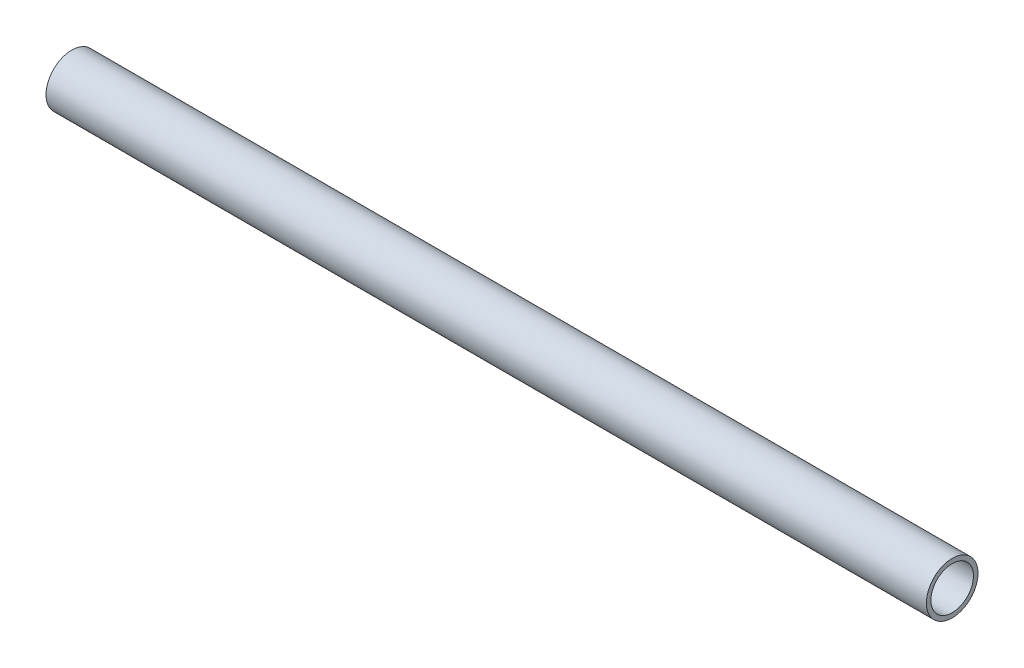
ISO-10303-21;
HEADER;
FILE_DESCRIPTION(('STEP AP214'),'2;1');
FILE_NAME('part.step','',(''),(''),'','','');
FILE_SCHEMA(('AUTOMOTIVE_DESIGN { 1 0 10303 214 1 1 1 1 }'));
ENDSEC;
DATA;
#1=APPLICATION_CONTEXT('core data for automotive mechanical design processes');
#2=APPLICATION_PROTOCOL_DEFINITION('international standard','automotive_design',2000,#1);
#3=PRODUCT_CONTEXT('',#1,'mechanical');
#4=PRODUCT('Part','Part','',(#3));
#5=PRODUCT_RELATED_PRODUCT_CATEGORY('part','',(#4));
#6=PRODUCT_DEFINITION_FORMATION('','',#4);
#7=PRODUCT_DEFINITION_CONTEXT('part definition',#1,'design');
#8=PRODUCT_DEFINITION('design','',#6,#7);
#9=PRODUCT_DEFINITION_SHAPE('','',#8);
#10=(LENGTH_UNIT() NAMED_UNIT(*) SI_UNIT(.MILLI.,.METRE.));
#11=(NAMED_UNIT(*) PLANE_ANGLE_UNIT() SI_UNIT($,.RADIAN.));
#12=(NAMED_UNIT(*) SI_UNIT($,.STERADIAN.) SOLID_ANGLE_UNIT());
#13=UNCERTAINTY_MEASURE_WITH_UNIT(LENGTH_MEASURE(1.E-05),#10,'distance_accuracy_value','');
#14=(GEOMETRIC_REPRESENTATION_CONTEXT(3) GLOBAL_UNCERTAINTY_ASSIGNED_CONTEXT((#13)) GLOBAL_UNIT_ASSIGNED_CONTEXT((#10,
#11,#12)) REPRESENTATION_CONTEXT('',''));
#15=CARTESIAN_POINT('',(0.,0.,0.));
#16=DIRECTION('',(0.,0.,1.));
#17=DIRECTION('',(1.,0.,0.));
#18=AXIS2_PLACEMENT_3D('',#15,#16,#17);
#19=CARTESIAN_POINT('',(-256.746551449481,657.25042092771,0.));
#20=DIRECTION('',(1.,0.,0.));
#21=DIRECTION('',(0.,0.,-1.));
#22=AXIS2_PLACEMENT_3D('',#19,#20,#21);
#23=CYLINDRICAL_SURFACE('',#22,2.6162);
#24=CARTESIAN_POINT('',(-256.746551449481,657.25042092771,0.));
#25=DIRECTION('',(-1.,0.,0.));
#26=DIRECTION('',(0.,-1.,0.));
#27=AXIS2_PLACEMENT_3D('',#24,#25,#26);
#28=CIRCLE('',#27,2.6162);
#29=CARTESIAN_POINT('',(-256.746551449481,654.63422092771,0.));
#30=VERTEX_POINT('',#29);
#31=EDGE_CURVE('E44',#30,#30,#28,.T.);
#32=ORIENTED_EDGE('',*,*,#31,.T.);
#33=EDGE_LOOP('',(#32));
#34=FACE_BOUND('',#33,.T.);
#35=CARTESIAN_POINT('',(-148.488053197196,657.25042092771,0.));
#36=DIRECTION('',(-1.,0.,0.));
#37=DIRECTION('',(0.,-1.,0.));
#38=AXIS2_PLACEMENT_3D('',#35,#36,#37);
#39=CIRCLE('',#38,2.6162);
#40=CARTESIAN_POINT('',(-148.488053197196,654.63422092771,0.));
#41=VERTEX_POINT('',#40);
#42=EDGE_CURVE('E50',#41,#41,#39,.T.);
#43=ORIENTED_EDGE('',*,*,#42,.F.);
#44=EDGE_LOOP('',(#43));
#45=FACE_BOUND('',#44,.T.);
#46=ADVANCED_FACE('F37',(#34,#45),#23,.F.);
#47=CARTESIAN_POINT('',(-256.746551449481,657.25042092771,0.));
#48=DIRECTION('',(1.,0.,0.));
#49=DIRECTION('',(0.,0.,-1.));
#50=AXIS2_PLACEMENT_3D('',#47,#48,#49);
#51=CYLINDRICAL_SURFACE('',#50,3.175);
#52=CARTESIAN_POINT('',(-256.746551449481,657.25042092771,0.));
#53=DIRECTION('',(-1.,0.,0.));
#54=DIRECTION('',(0.,-1.,0.));
#55=AXIS2_PLACEMENT_3D('',#52,#53,#54);
#56=CIRCLE('',#55,3.175);
#57=CARTESIAN_POINT('',(-256.746551449481,654.07542092771,0.));
#58=VERTEX_POINT('',#57);
#59=EDGE_CURVE('E11',#58,#58,#56,.T.);
#60=ORIENTED_EDGE('',*,*,#59,.F.);
#61=EDGE_LOOP('',(#60));
#62=FACE_BOUND('',#61,.T.);
#63=CARTESIAN_POINT('',(-148.488053197196,657.25042092771,0.));
#64=DIRECTION('',(-1.,0.,0.));
#65=DIRECTION('',(0.,-1.,0.));
#66=AXIS2_PLACEMENT_3D('',#63,#64,#65);
#67=CIRCLE('',#66,3.175);
#68=CARTESIAN_POINT('',(-148.488053197196,654.07542092771,0.));
#69=VERTEX_POINT('',#68);
#70=EDGE_CURVE('E40',#69,#69,#67,.T.);
#71=ORIENTED_EDGE('',*,*,#70,.T.);
#72=EDGE_LOOP('',(#71));
#73=FACE_BOUND('',#72,.T.);
#74=ADVANCED_FACE('F57',(#62,#73),#51,.T.);
#75=CARTESIAN_POINT('',(-256.746551449481,657.25042092771,0.));
#76=DIRECTION('',(-1.,0.,0.));
#77=DIRECTION('',(0.,-1.,0.));
#78=AXIS2_PLACEMENT_3D('',#75,#76,#77);
#79=PLANE('',#78);
#80=ORIENTED_EDGE('',*,*,#31,.F.);
#81=EDGE_LOOP('',(#80));
#82=FACE_BOUND('',#81,.T.);
#83=ORIENTED_EDGE('',*,*,#59,.T.);
#84=EDGE_LOOP('',(#83));
#85=FACE_BOUND('',#84,.T.);
#86=ADVANCED_FACE('F61',(#82,#85),#79,.T.);
#87=CARTESIAN_POINT('',(-148.488053197196,657.25042092771,0.));
#88=DIRECTION('',(-1.,0.,0.));
#89=DIRECTION('',(0.,-1.,0.));
#90=AXIS2_PLACEMENT_3D('',#87,#88,#89);
#91=PLANE('',#90);
#92=ORIENTED_EDGE('',*,*,#42,.T.);
#93=EDGE_LOOP('',(#92));
#94=FACE_BOUND('',#93,.T.);
#95=ORIENTED_EDGE('',*,*,#70,.F.);
#96=EDGE_LOOP('',(#95));
#97=FACE_BOUND('',#96,.T.);
#98=ADVANCED_FACE('F59',(#94,#97),#91,.F.);
#99=CLOSED_SHELL('',(#46,#74,#86,#98));
#100=MANIFOLD_SOLID_BREP('B2',#99);
#101=ADVANCED_BREP_SHAPE_REPRESENTATION('',(#18,#100),#14);
#102=SHAPE_DEFINITION_REPRESENTATION(#9,#101);
ENDSEC;
END-ISO-10303-21;
